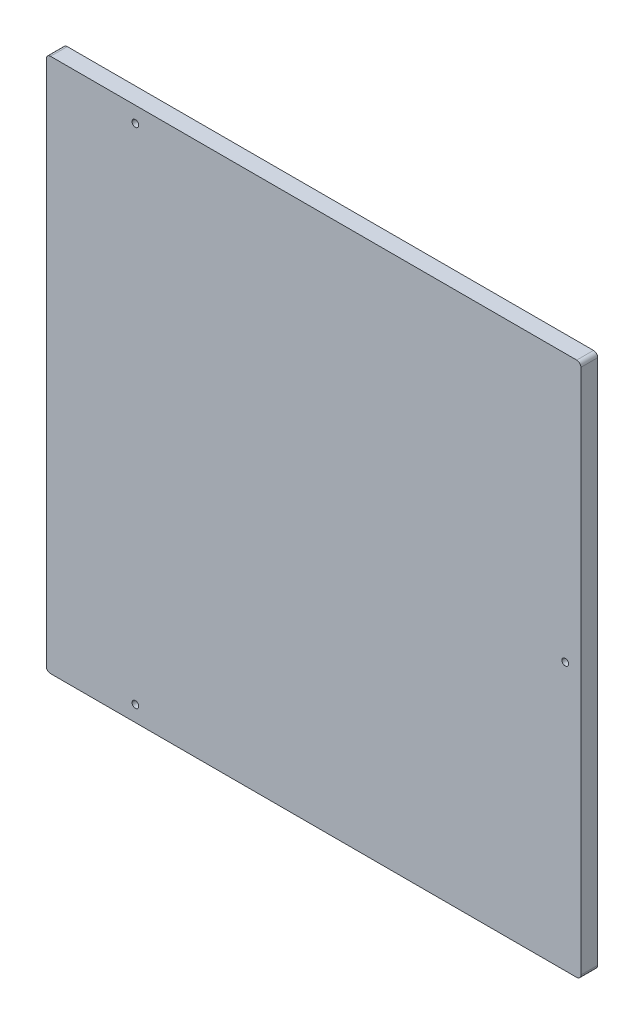
ISO-10303-21;
HEADER;
FILE_DESCRIPTION(('STEP AP214'),'2;1');
FILE_NAME('part.step','',(''),(''),'','','');
FILE_SCHEMA(('AUTOMOTIVE_DESIGN { 1 0 10303 214 1 1 1 1 }'));
ENDSEC;
DATA;
#1=APPLICATION_CONTEXT('core data for automotive mechanical design processes');
#2=APPLICATION_PROTOCOL_DEFINITION('international standard','automotive_design',2000,#1);
#3=PRODUCT_CONTEXT('',#1,'mechanical');
#4=PRODUCT('Part','Part','',(#3));
#5=PRODUCT_RELATED_PRODUCT_CATEGORY('part','',(#4));
#6=PRODUCT_DEFINITION_FORMATION('','',#4);
#7=PRODUCT_DEFINITION_CONTEXT('part definition',#1,'design');
#8=PRODUCT_DEFINITION('design','',#6,#7);
#9=PRODUCT_DEFINITION_SHAPE('','',#8);
#10=(LENGTH_UNIT() NAMED_UNIT(*) SI_UNIT(.MILLI.,.METRE.));
#11=(NAMED_UNIT(*) PLANE_ANGLE_UNIT() SI_UNIT($,.RADIAN.));
#12=(NAMED_UNIT(*) SI_UNIT($,.STERADIAN.) SOLID_ANGLE_UNIT());
#13=UNCERTAINTY_MEASURE_WITH_UNIT(LENGTH_MEASURE(1.E-05),#10,'distance_accuracy_value','');
#14=(GEOMETRIC_REPRESENTATION_CONTEXT(3) GLOBAL_UNCERTAINTY_ASSIGNED_CONTEXT((#13)) GLOBAL_UNIT_ASSIGNED_CONTEXT((#10,
#11,#12)) REPRESENTATION_CONTEXT('',''));
#15=CARTESIAN_POINT('',(0.,0.,0.));
#16=DIRECTION('',(0.,0.,1.));
#17=DIRECTION('',(1.,0.,0.));
#18=AXIS2_PLACEMENT_3D('',#15,#16,#17);
#19=CARTESIAN_POINT('',(0.,0.,8.));
#20=DIRECTION('',(0.,0.,1.));
#21=DIRECTION('',(1.,0.,0.));
#22=AXIS2_PLACEMENT_3D('',#19,#20,#21);
#23=PLANE('',#22);
#24=CARTESIAN_POINT('',(247.5,127.5,8.));
#25=DIRECTION('',(0.,0.,1.));
#26=DIRECTION('',(1.,0.,0.));
#27=AXIS2_PLACEMENT_3D('',#24,#25,#26);
#28=CIRCLE('',#27,1.6);
#29=CARTESIAN_POINT('',(245.9,127.5,8.));
#30=VERTEX_POINT('',#29);
#31=CARTESIAN_POINT('',(249.1,127.5,8.));
#32=VERTEX_POINT('',#31);
#33=EDGE_CURVE('E161',#30,#32,#28,.T.);
#34=ORIENTED_EDGE('',*,*,#33,.F.);
#35=CARTESIAN_POINT('',(247.5,127.5,8.));
#36=DIRECTION('',(0.,0.,1.));
#37=DIRECTION('',(1.,0.,0.));
#38=AXIS2_PLACEMENT_3D('',#35,#36,#37);
#39=CIRCLE('',#38,1.6);
#40=EDGE_CURVE('E26',#32,#30,#39,.T.);
#41=ORIENTED_EDGE('',*,*,#40,.F.);
#42=EDGE_LOOP('',(#34,#41));
#43=FACE_BOUND('',#42,.T.);
#44=CARTESIAN_POINT('',(42.5,7.5,8.));
#45=DIRECTION('',(0.,0.,1.));
#46=DIRECTION('',(1.,0.,0.));
#47=AXIS2_PLACEMENT_3D('',#44,#45,#46);
#48=CIRCLE('',#47,1.6);
#49=CARTESIAN_POINT('',(40.9,7.5,8.));
#50=VERTEX_POINT('',#49);
#51=CARTESIAN_POINT('',(44.1,7.5,8.));
#52=VERTEX_POINT('',#51);
#53=EDGE_CURVE('E135',#50,#52,#48,.T.);
#54=ORIENTED_EDGE('',*,*,#53,.F.);
#55=CARTESIAN_POINT('',(42.5,7.5,8.));
#56=DIRECTION('',(0.,0.,1.));
#57=DIRECTION('',(1.,0.,0.));
#58=AXIS2_PLACEMENT_3D('',#55,#56,#57);
#59=CIRCLE('',#58,1.6);
#60=EDGE_CURVE('E120',#52,#50,#59,.T.);
#61=ORIENTED_EDGE('',*,*,#60,.F.);
#62=EDGE_LOOP('',(#54,#61));
#63=FACE_BOUND('',#62,.T.);
#64=CARTESIAN_POINT('',(42.5,247.5,8.));
#65=DIRECTION('',(0.,0.,1.));
#66=DIRECTION('',(1.,0.,0.));
#67=AXIS2_PLACEMENT_3D('',#64,#65,#66);
#68=CIRCLE('',#67,1.6);
#69=CARTESIAN_POINT('',(40.9,247.5,8.));
#70=VERTEX_POINT('',#69);
#71=CARTESIAN_POINT('',(44.1,247.5,8.));
#72=VERTEX_POINT('',#71);
#73=EDGE_CURVE('E254',#70,#72,#68,.T.);
#74=ORIENTED_EDGE('',*,*,#73,.F.);
#75=CARTESIAN_POINT('',(42.5,247.5,8.));
#76=DIRECTION('',(0.,0.,1.));
#77=DIRECTION('',(1.,0.,0.));
#78=AXIS2_PLACEMENT_3D('',#75,#76,#77);
#79=CIRCLE('',#78,1.6);
#80=EDGE_CURVE('E19',#72,#70,#79,.T.);
#81=ORIENTED_EDGE('',*,*,#80,.F.);
#82=EDGE_LOOP('',(#74,#81));
#83=FACE_BOUND('',#82,.T.);
#84=DIRECTION('',(1.,0.,0.));
#85=VECTOR('',#84,1.);
#86=CARTESIAN_POINT('',(127.5,0.,8.));
#87=LINE('',#86,#85);
#88=CARTESIAN_POINT('',(2.,0.,8.));
#89=VERTEX_POINT('',#88);
#90=CARTESIAN_POINT('',(253.,0.,8.));
#91=VERTEX_POINT('',#90);
#92=EDGE_CURVE('E243',#89,#91,#87,.T.);
#93=ORIENTED_EDGE('',*,*,#92,.T.);
#94=CARTESIAN_POINT('',(253.,2.,8.));
#95=DIRECTION('',(0.,0.,1.));
#96=DIRECTION('',(1.,0.,0.));
#97=AXIS2_PLACEMENT_3D('',#94,#95,#96);
#98=CIRCLE('',#97,2.);
#99=CARTESIAN_POINT('',(255.,2.,8.));
#100=VERTEX_POINT('',#99);
#101=EDGE_CURVE('E181',#91,#100,#98,.T.);
#102=ORIENTED_EDGE('',*,*,#101,.T.);
#103=DIRECTION('',(0.,1.,0.));
#104=VECTOR('',#103,1.);
#105=CARTESIAN_POINT('',(255.,127.5,8.));
#106=LINE('',#105,#104);
#107=CARTESIAN_POINT('',(255.,253.,8.));
#108=VERTEX_POINT('',#107);
#109=EDGE_CURVE('E166',#100,#108,#106,.T.);
#110=ORIENTED_EDGE('',*,*,#109,.T.);
#111=CARTESIAN_POINT('',(253.,253.,8.));
#112=DIRECTION('',(0.,0.,1.));
#113=DIRECTION('',(1.,0.,0.));
#114=AXIS2_PLACEMENT_3D('',#111,#112,#113);
#115=CIRCLE('',#114,2.);
#116=CARTESIAN_POINT('',(253.,255.,8.));
#117=VERTEX_POINT('',#116);
#118=EDGE_CURVE('E175',#108,#117,#115,.T.);
#119=ORIENTED_EDGE('',*,*,#118,.T.);
#120=DIRECTION('',(-1.,0.,0.));
#121=VECTOR('',#120,1.);
#122=CARTESIAN_POINT('',(127.5,255.,8.));
#123=LINE('',#122,#121);
#124=CARTESIAN_POINT('',(2.,255.,8.));
#125=VERTEX_POINT('',#124);
#126=EDGE_CURVE('E184',#117,#125,#123,.T.);
#127=ORIENTED_EDGE('',*,*,#126,.T.);
#128=CARTESIAN_POINT('',(2.,253.,8.));
#129=DIRECTION('',(0.,0.,1.));
#130=DIRECTION('',(1.,0.,0.));
#131=AXIS2_PLACEMENT_3D('',#128,#129,#130);
#132=CIRCLE('',#131,2.);
#133=CARTESIAN_POINT('',(0.,253.,8.));
#134=VERTEX_POINT('',#133);
#135=EDGE_CURVE('E216',#125,#134,#132,.T.);
#136=ORIENTED_EDGE('',*,*,#135,.T.);
#137=DIRECTION('',(0.,-1.,0.));
#138=VECTOR('',#137,1.);
#139=CARTESIAN_POINT('',(0.,127.5,8.));
#140=LINE('',#139,#138);
#141=CARTESIAN_POINT('',(0.,2.,8.));
#142=VERTEX_POINT('',#141);
#143=EDGE_CURVE('E236',#134,#142,#140,.T.);
#144=ORIENTED_EDGE('',*,*,#143,.T.);
#145=CARTESIAN_POINT('',(2.,2.,8.));
#146=DIRECTION('',(0.,0.,1.));
#147=DIRECTION('',(1.,0.,0.));
#148=AXIS2_PLACEMENT_3D('',#145,#146,#147);
#149=CIRCLE('',#148,2.);
#150=EDGE_CURVE('E154',#142,#89,#149,.T.);
#151=ORIENTED_EDGE('',*,*,#150,.T.);
#152=EDGE_LOOP('',(#93,#102,#110,#119,#127,#136,#144,#151));
#153=FACE_BOUND('',#152,.T.);
#154=ADVANCED_FACE('F16',(#43,#63,#83,#153),#23,.T.);
#155=CARTESIAN_POINT('',(0.,0.,0.));
#156=DIRECTION('',(0.,0.,1.));
#157=DIRECTION('',(1.,0.,0.));
#158=AXIS2_PLACEMENT_3D('',#155,#156,#157);
#159=PLANE('',#158);
#160=CARTESIAN_POINT('',(247.5,127.5,0.));
#161=DIRECTION('',(0.,0.,1.));
#162=DIRECTION('',(1.,0.,0.));
#163=AXIS2_PLACEMENT_3D('',#160,#161,#162);
#164=CIRCLE('',#163,1.6);
#165=CARTESIAN_POINT('',(249.1,127.5,0.));
#166=VERTEX_POINT('',#165);
#167=CARTESIAN_POINT('',(245.9,127.5,0.));
#168=VERTEX_POINT('',#167);
#169=EDGE_CURVE('E11',#166,#168,#164,.T.);
#170=ORIENTED_EDGE('',*,*,#169,.T.);
#171=CARTESIAN_POINT('',(247.5,127.5,0.));
#172=DIRECTION('',(0.,0.,1.));
#173=DIRECTION('',(1.,0.,0.));
#174=AXIS2_PLACEMENT_3D('',#171,#172,#173);
#175=CIRCLE('',#174,1.6);
#176=EDGE_CURVE('E160',#168,#166,#175,.T.);
#177=ORIENTED_EDGE('',*,*,#176,.T.);
#178=EDGE_LOOP('',(#170,#177));
#179=FACE_BOUND('',#178,.T.);
#180=CARTESIAN_POINT('',(42.5,7.5,0.));
#181=DIRECTION('',(0.,0.,1.));
#182=DIRECTION('',(1.,0.,0.));
#183=AXIS2_PLACEMENT_3D('',#180,#181,#182);
#184=CIRCLE('',#183,1.6);
#185=CARTESIAN_POINT('',(44.1,7.5,0.));
#186=VERTEX_POINT('',#185);
#187=CARTESIAN_POINT('',(40.9,7.5,0.));
#188=VERTEX_POINT('',#187);
#189=EDGE_CURVE('E131',#186,#188,#184,.T.);
#190=ORIENTED_EDGE('',*,*,#189,.T.);
#191=CARTESIAN_POINT('',(42.5,7.5,0.));
#192=DIRECTION('',(0.,0.,1.));
#193=DIRECTION('',(1.,0.,0.));
#194=AXIS2_PLACEMENT_3D('',#191,#192,#193);
#195=CIRCLE('',#194,1.6);
#196=EDGE_CURVE('E137',#188,#186,#195,.T.);
#197=ORIENTED_EDGE('',*,*,#196,.T.);
#198=EDGE_LOOP('',(#190,#197));
#199=FACE_BOUND('',#198,.T.);
#200=CARTESIAN_POINT('',(42.5,247.5,0.));
#201=DIRECTION('',(0.,0.,1.));
#202=DIRECTION('',(1.,0.,0.));
#203=AXIS2_PLACEMENT_3D('',#200,#201,#202);
#204=CIRCLE('',#203,1.6);
#205=CARTESIAN_POINT('',(44.1,247.5,0.));
#206=VERTEX_POINT('',#205);
#207=CARTESIAN_POINT('',(40.9,247.5,0.));
#208=VERTEX_POINT('',#207);
#209=EDGE_CURVE('E142',#206,#208,#204,.T.);
#210=ORIENTED_EDGE('',*,*,#209,.T.);
#211=CARTESIAN_POINT('',(42.5,247.5,0.));
#212=DIRECTION('',(0.,0.,1.));
#213=DIRECTION('',(1.,0.,0.));
#214=AXIS2_PLACEMENT_3D('',#211,#212,#213);
#215=CIRCLE('',#214,1.6);
#216=EDGE_CURVE('E212',#208,#206,#215,.T.);
#217=ORIENTED_EDGE('',*,*,#216,.T.);
#218=EDGE_LOOP('',(#210,#217));
#219=FACE_BOUND('',#218,.T.);
#220=CARTESIAN_POINT('',(2.,2.,0.));
#221=DIRECTION('',(0.,0.,1.));
#222=DIRECTION('',(1.,0.,0.));
#223=AXIS2_PLACEMENT_3D('',#220,#221,#222);
#224=CIRCLE('',#223,2.);
#225=CARTESIAN_POINT('',(0.,2.,0.));
#226=VERTEX_POINT('',#225);
#227=CARTESIAN_POINT('',(2.,0.,0.));
#228=VERTEX_POINT('',#227);
#229=EDGE_CURVE('E248',#226,#228,#224,.T.);
#230=ORIENTED_EDGE('',*,*,#229,.F.);
#231=DIRECTION('',(0.,-1.,0.));
#232=VECTOR('',#231,1.);
#233=CARTESIAN_POINT('',(0.,127.5,0.));
#234=LINE('',#233,#232);
#235=CARTESIAN_POINT('',(0.,253.,0.));
#236=VERTEX_POINT('',#235);
#237=EDGE_CURVE('E228',#236,#226,#234,.T.);
#238=ORIENTED_EDGE('',*,*,#237,.F.);
#239=CARTESIAN_POINT('',(2.,253.,0.));
#240=DIRECTION('',(0.,0.,1.));
#241=DIRECTION('',(1.,0.,0.));
#242=AXIS2_PLACEMENT_3D('',#239,#240,#241);
#243=CIRCLE('',#242,2.);
#244=CARTESIAN_POINT('',(2.,255.,0.));
#245=VERTEX_POINT('',#244);
#246=EDGE_CURVE('E187',#245,#236,#243,.T.);
#247=ORIENTED_EDGE('',*,*,#246,.F.);
#248=DIRECTION('',(-1.,0.,0.));
#249=VECTOR('',#248,1.);
#250=CARTESIAN_POINT('',(127.5,255.,0.));
#251=LINE('',#250,#249);
#252=CARTESIAN_POINT('',(253.,255.,0.));
#253=VERTEX_POINT('',#252);
#254=EDGE_CURVE('E200',#253,#245,#251,.T.);
#255=ORIENTED_EDGE('',*,*,#254,.F.);
#256=CARTESIAN_POINT('',(253.,253.,0.));
#257=DIRECTION('',(0.,0.,1.));
#258=DIRECTION('',(1.,0.,0.));
#259=AXIS2_PLACEMENT_3D('',#256,#257,#258);
#260=CIRCLE('',#259,2.);
#261=CARTESIAN_POINT('',(255.,253.,0.));
#262=VERTEX_POINT('',#261);
#263=EDGE_CURVE('E176',#262,#253,#260,.T.);
#264=ORIENTED_EDGE('',*,*,#263,.F.);
#265=DIRECTION('',(0.,1.,0.));
#266=VECTOR('',#265,1.);
#267=CARTESIAN_POINT('',(255.,127.5,0.));
#268=LINE('',#267,#266);
#269=CARTESIAN_POINT('',(255.,2.,0.));
#270=VERTEX_POINT('',#269);
#271=EDGE_CURVE('E167',#270,#262,#268,.T.);
#272=ORIENTED_EDGE('',*,*,#271,.F.);
#273=CARTESIAN_POINT('',(253.,2.,0.));
#274=DIRECTION('',(0.,0.,1.));
#275=DIRECTION('',(1.,0.,0.));
#276=AXIS2_PLACEMENT_3D('',#273,#274,#275);
#277=CIRCLE('',#276,2.);
#278=CARTESIAN_POINT('',(253.,0.,0.));
#279=VERTEX_POINT('',#278);
#280=EDGE_CURVE('E246',#279,#270,#277,.T.);
#281=ORIENTED_EDGE('',*,*,#280,.F.);
#282=DIRECTION('',(1.,0.,0.));
#283=VECTOR('',#282,1.);
#284=CARTESIAN_POINT('',(127.5,0.,0.));
#285=LINE('',#284,#283);
#286=EDGE_CURVE('E237',#228,#279,#285,.T.);
#287=ORIENTED_EDGE('',*,*,#286,.F.);
#288=EDGE_LOOP('',(#230,#238,#247,#255,#264,#272,#281,#287));
#289=FACE_BOUND('',#288,.T.);
#290=ADVANCED_FACE('F294',(#179,#199,#219,#289),#159,.F.);
#291=CARTESIAN_POINT('',(247.5,127.5,4.));
#292=DIRECTION('',(0.,0.,1.));
#293=DIRECTION('',(1.,0.,0.));
#294=AXIS2_PLACEMENT_3D('',#291,#292,#293);
#295=CYLINDRICAL_SURFACE('',#294,1.6);
#296=ORIENTED_EDGE('',*,*,#40,.T.);
#297=DIRECTION('',(0.,0.,1.));
#298=VECTOR('',#297,1.);
#299=CARTESIAN_POINT('',(245.9,127.5,4.));
#300=LINE('',#299,#298);
#301=EDGE_CURVE('E177',#168,#30,#300,.T.);
#302=ORIENTED_EDGE('',*,*,#301,.F.);
#303=ORIENTED_EDGE('',*,*,#169,.F.);
#304=DIRECTION('',(0.,0.,1.));
#305=VECTOR('',#304,1.);
#306=CARTESIAN_POINT('',(249.1,127.5,4.));
#307=LINE('',#306,#305);
#308=EDGE_CURVE('E156',#166,#32,#307,.T.);
#309=ORIENTED_EDGE('',*,*,#308,.T.);
#310=EDGE_LOOP('',(#296,#302,#303,#309));
#311=FACE_BOUND('',#310,.T.);
#312=ADVANCED_FACE('F334',(#311),#295,.F.);
#313=CARTESIAN_POINT('',(247.5,127.5,4.));
#314=DIRECTION('',(0.,0.,1.));
#315=DIRECTION('',(1.,0.,0.));
#316=AXIS2_PLACEMENT_3D('',#313,#314,#315);
#317=CYLINDRICAL_SURFACE('',#316,1.6);
#318=ORIENTED_EDGE('',*,*,#33,.T.);
#319=ORIENTED_EDGE('',*,*,#308,.F.);
#320=ORIENTED_EDGE('',*,*,#176,.F.);
#321=ORIENTED_EDGE('',*,*,#301,.T.);
#322=EDGE_LOOP('',(#318,#319,#320,#321));
#323=FACE_BOUND('',#322,.T.);
#324=ADVANCED_FACE('F328',(#323),#317,.F.);
#325=CARTESIAN_POINT('',(42.5,7.5,4.));
#326=DIRECTION('',(0.,0.,1.));
#327=DIRECTION('',(1.,0.,0.));
#328=AXIS2_PLACEMENT_3D('',#325,#326,#327);
#329=CYLINDRICAL_SURFACE('',#328,1.6);
#330=ORIENTED_EDGE('',*,*,#60,.T.);
#331=DIRECTION('',(0.,0.,1.));
#332=VECTOR('',#331,1.);
#333=CARTESIAN_POINT('',(40.9,7.5,4.));
#334=LINE('',#333,#332);
#335=EDGE_CURVE('E123',#188,#50,#334,.T.);
#336=ORIENTED_EDGE('',*,*,#335,.F.);
#337=ORIENTED_EDGE('',*,*,#189,.F.);
#338=DIRECTION('',(0.,0.,1.));
#339=VECTOR('',#338,1.);
#340=CARTESIAN_POINT('',(44.1,7.5,4.));
#341=LINE('',#340,#339);
#342=EDGE_CURVE('E126',#186,#52,#341,.T.);
#343=ORIENTED_EDGE('',*,*,#342,.T.);
#344=EDGE_LOOP('',(#330,#336,#337,#343));
#345=FACE_BOUND('',#344,.T.);
#346=ADVANCED_FACE('F122',(#345),#329,.F.);
#347=CARTESIAN_POINT('',(42.5,7.5,4.));
#348=DIRECTION('',(0.,0.,1.));
#349=DIRECTION('',(1.,0.,0.));
#350=AXIS2_PLACEMENT_3D('',#347,#348,#349);
#351=CYLINDRICAL_SURFACE('',#350,1.6);
#352=ORIENTED_EDGE('',*,*,#53,.T.);
#353=ORIENTED_EDGE('',*,*,#342,.F.);
#354=ORIENTED_EDGE('',*,*,#196,.F.);
#355=ORIENTED_EDGE('',*,*,#335,.T.);
#356=EDGE_LOOP('',(#352,#353,#354,#355));
#357=FACE_BOUND('',#356,.T.);
#358=ADVANCED_FACE('F134',(#357),#351,.F.);
#359=CARTESIAN_POINT('',(42.5,247.5,4.));
#360=DIRECTION('',(0.,0.,1.));
#361=DIRECTION('',(1.,0.,0.));
#362=AXIS2_PLACEMENT_3D('',#359,#360,#361);
#363=CYLINDRICAL_SURFACE('',#362,1.6);
#364=ORIENTED_EDGE('',*,*,#80,.T.);
#365=DIRECTION('',(0.,0.,1.));
#366=VECTOR('',#365,1.);
#367=CARTESIAN_POINT('',(40.9,247.5,4.));
#368=LINE('',#367,#366);
#369=EDGE_CURVE('E223',#208,#70,#368,.T.);
#370=ORIENTED_EDGE('',*,*,#369,.F.);
#371=ORIENTED_EDGE('',*,*,#209,.F.);
#372=DIRECTION('',(0.,0.,1.));
#373=VECTOR('',#372,1.);
#374=CARTESIAN_POINT('',(44.1,247.5,4.));
#375=LINE('',#374,#373);
#376=EDGE_CURVE('E257',#206,#72,#375,.T.);
#377=ORIENTED_EDGE('',*,*,#376,.T.);
#378=EDGE_LOOP('',(#364,#370,#371,#377));
#379=FACE_BOUND('',#378,.T.);
#380=ADVANCED_FACE('F371',(#379),#363,.F.);
#381=CARTESIAN_POINT('',(42.5,247.5,4.));
#382=DIRECTION('',(0.,0.,1.));
#383=DIRECTION('',(1.,0.,0.));
#384=AXIS2_PLACEMENT_3D('',#381,#382,#383);
#385=CYLINDRICAL_SURFACE('',#384,1.6);
#386=ORIENTED_EDGE('',*,*,#73,.T.);
#387=ORIENTED_EDGE('',*,*,#376,.F.);
#388=ORIENTED_EDGE('',*,*,#216,.F.);
#389=ORIENTED_EDGE('',*,*,#369,.T.);
#390=EDGE_LOOP('',(#386,#387,#388,#389));
#391=FACE_BOUND('',#390,.T.);
#392=ADVANCED_FACE('F366',(#391),#385,.F.);
#393=CARTESIAN_POINT('',(2.,2.,4.));
#394=DIRECTION('',(0.,0.,1.));
#395=DIRECTION('',(-1.,0.,0.));
#396=AXIS2_PLACEMENT_3D('',#393,#394,#395);
#397=CYLINDRICAL_SURFACE('',#396,2.);
#398=DIRECTION('',(0.,0.,1.));
#399=VECTOR('',#398,1.);
#400=CARTESIAN_POINT('',(0.,2.,4.));
#401=LINE('',#400,#399);
#402=EDGE_CURVE('E232',#226,#142,#401,.T.);
#403=ORIENTED_EDGE('',*,*,#402,.F.);
#404=ORIENTED_EDGE('',*,*,#229,.T.);
#405=DIRECTION('',(0.,0.,1.));
#406=VECTOR('',#405,1.);
#407=CARTESIAN_POINT('',(2.,0.,4.));
#408=LINE('',#407,#406);
#409=EDGE_CURVE('E242',#228,#89,#408,.T.);
#410=ORIENTED_EDGE('',*,*,#409,.T.);
#411=ORIENTED_EDGE('',*,*,#150,.F.);
#412=EDGE_LOOP('',(#403,#404,#410,#411));
#413=FACE_BOUND('',#412,.T.);
#414=ADVANCED_FACE('F304',(#413),#397,.T.);
#415=CARTESIAN_POINT('',(0.,253.,0.));
#416=DIRECTION('',(-1.,0.,0.));
#417=DIRECTION('',(0.,0.,1.));
#418=AXIS2_PLACEMENT_3D('',#415,#416,#417);
#419=PLANE('',#418);
#420=DIRECTION('',(0.,0.,1.));
#421=VECTOR('',#420,1.);
#422=CARTESIAN_POINT('',(0.,253.,4.));
#423=LINE('',#422,#421);
#424=EDGE_CURVE('E197',#236,#134,#423,.T.);
#425=ORIENTED_EDGE('',*,*,#424,.F.);
#426=ORIENTED_EDGE('',*,*,#237,.T.);
#427=ORIENTED_EDGE('',*,*,#402,.T.);
#428=ORIENTED_EDGE('',*,*,#143,.F.);
#429=EDGE_LOOP('',(#425,#426,#427,#428));
#430=FACE_BOUND('',#429,.T.);
#431=ADVANCED_FACE('F302',(#430),#419,.T.);
#432=CARTESIAN_POINT('',(2.,253.,4.));
#433=DIRECTION('',(0.,0.,1.));
#434=DIRECTION('',(0.,1.,0.));
#435=AXIS2_PLACEMENT_3D('',#432,#433,#434);
#436=CYLINDRICAL_SURFACE('',#435,2.);
#437=DIRECTION('',(0.,0.,1.));
#438=VECTOR('',#437,1.);
#439=CARTESIAN_POINT('',(2.,255.,4.));
#440=LINE('',#439,#438);
#441=EDGE_CURVE('E188',#245,#125,#440,.T.);
#442=ORIENTED_EDGE('',*,*,#441,.F.);
#443=ORIENTED_EDGE('',*,*,#246,.T.);
#444=ORIENTED_EDGE('',*,*,#424,.T.);
#445=ORIENTED_EDGE('',*,*,#135,.F.);
#446=EDGE_LOOP('',(#442,#443,#444,#445));
#447=FACE_BOUND('',#446,.T.);
#448=ADVANCED_FACE('F298',(#447),#436,.T.);
#449=CARTESIAN_POINT('',(253.,255.,0.));
#450=DIRECTION('',(0.,1.,0.));
#451=DIRECTION('',(1.,0.,0.));
#452=AXIS2_PLACEMENT_3D('',#449,#450,#451);
#453=PLANE('',#452);
#454=DIRECTION('',(0.,0.,1.));
#455=VECTOR('',#454,1.);
#456=CARTESIAN_POINT('',(253.,255.,4.));
#457=LINE('',#456,#455);
#458=EDGE_CURVE('E171',#253,#117,#457,.T.);
#459=ORIENTED_EDGE('',*,*,#458,.F.);
#460=ORIENTED_EDGE('',*,*,#254,.T.);
#461=ORIENTED_EDGE('',*,*,#441,.T.);
#462=ORIENTED_EDGE('',*,*,#126,.F.);
#463=EDGE_LOOP('',(#459,#460,#461,#462));
#464=FACE_BOUND('',#463,.T.);
#465=ADVANCED_FACE('F289',(#464),#453,.T.);
#466=CARTESIAN_POINT('',(253.,253.,4.));
#467=DIRECTION('',(0.,0.,1.));
#468=DIRECTION('',(1.,0.,0.));
#469=AXIS2_PLACEMENT_3D('',#466,#467,#468);
#470=CYLINDRICAL_SURFACE('',#469,2.);
#471=DIRECTION('',(0.,0.,1.));
#472=VECTOR('',#471,1.);
#473=CARTESIAN_POINT('',(255.,253.,4.));
#474=LINE('',#473,#472);
#475=EDGE_CURVE('E162',#262,#108,#474,.T.);
#476=ORIENTED_EDGE('',*,*,#475,.F.);
#477=ORIENTED_EDGE('',*,*,#263,.T.);
#478=ORIENTED_EDGE('',*,*,#458,.T.);
#479=ORIENTED_EDGE('',*,*,#118,.F.);
#480=EDGE_LOOP('',(#476,#477,#478,#479));
#481=FACE_BOUND('',#480,.T.);
#482=ADVANCED_FACE('F288',(#481),#470,.T.);
#483=CARTESIAN_POINT('',(255.,2.,0.));
#484=DIRECTION('',(1.,0.,0.));
#485=DIRECTION('',(0.,1.,0.));
#486=AXIS2_PLACEMENT_3D('',#483,#484,#485);
#487=PLANE('',#486);
#488=DIRECTION('',(0.,0.,1.));
#489=VECTOR('',#488,1.);
#490=CARTESIAN_POINT('',(255.,2.,4.));
#491=LINE('',#490,#489);
#492=EDGE_CURVE('E183',#270,#100,#491,.T.);
#493=ORIENTED_EDGE('',*,*,#492,.F.);
#494=ORIENTED_EDGE('',*,*,#271,.T.);
#495=ORIENTED_EDGE('',*,*,#475,.T.);
#496=ORIENTED_EDGE('',*,*,#109,.F.);
#497=EDGE_LOOP('',(#493,#494,#495,#496));
#498=FACE_BOUND('',#497,.T.);
#499=ADVANCED_FACE('F383',(#498),#487,.T.);
#500=CARTESIAN_POINT('',(253.,2.,4.));
#501=DIRECTION('',(0.,0.,1.));
#502=DIRECTION('',(0.,-1.,0.));
#503=AXIS2_PLACEMENT_3D('',#500,#501,#502);
#504=CYLINDRICAL_SURFACE('',#503,2.);
#505=DIRECTION('',(0.,0.,1.));
#506=VECTOR('',#505,1.);
#507=CARTESIAN_POINT('',(253.,0.,4.));
#508=LINE('',#507,#506);
#509=EDGE_CURVE('E241',#279,#91,#508,.T.);
#510=ORIENTED_EDGE('',*,*,#509,.F.);
#511=ORIENTED_EDGE('',*,*,#280,.T.);
#512=ORIENTED_EDGE('',*,*,#492,.T.);
#513=ORIENTED_EDGE('',*,*,#101,.F.);
#514=EDGE_LOOP('',(#510,#511,#512,#513));
#515=FACE_BOUND('',#514,.T.);
#516=ADVANCED_FACE('F417',(#515),#504,.T.);
#517=CARTESIAN_POINT('',(2.,0.,0.));
#518=DIRECTION('',(0.,-1.,0.));
#519=DIRECTION('',(0.,0.,-1.));
#520=AXIS2_PLACEMENT_3D('',#517,#518,#519);
#521=PLANE('',#520);
#522=ORIENTED_EDGE('',*,*,#409,.F.);
#523=ORIENTED_EDGE('',*,*,#286,.T.);
#524=ORIENTED_EDGE('',*,*,#509,.T.);
#525=ORIENTED_EDGE('',*,*,#92,.F.);
#526=EDGE_LOOP('',(#522,#523,#524,#525));
#527=FACE_BOUND('',#526,.T.);
#528=ADVANCED_FACE('F422',(#527),#521,.T.);
#529=CLOSED_SHELL('',(#154,#290,#312,#324,#346,#358,#380,#392,#414,#431,#448,#465,#482,#499,
#516,#528));
#530=MANIFOLD_SOLID_BREP('B1',#529);
#531=ADVANCED_BREP_SHAPE_REPRESENTATION('',(#18,#530),#14);
#532=SHAPE_DEFINITION_REPRESENTATION(#9,#531);
ENDSEC;
END-ISO-10303-21;
